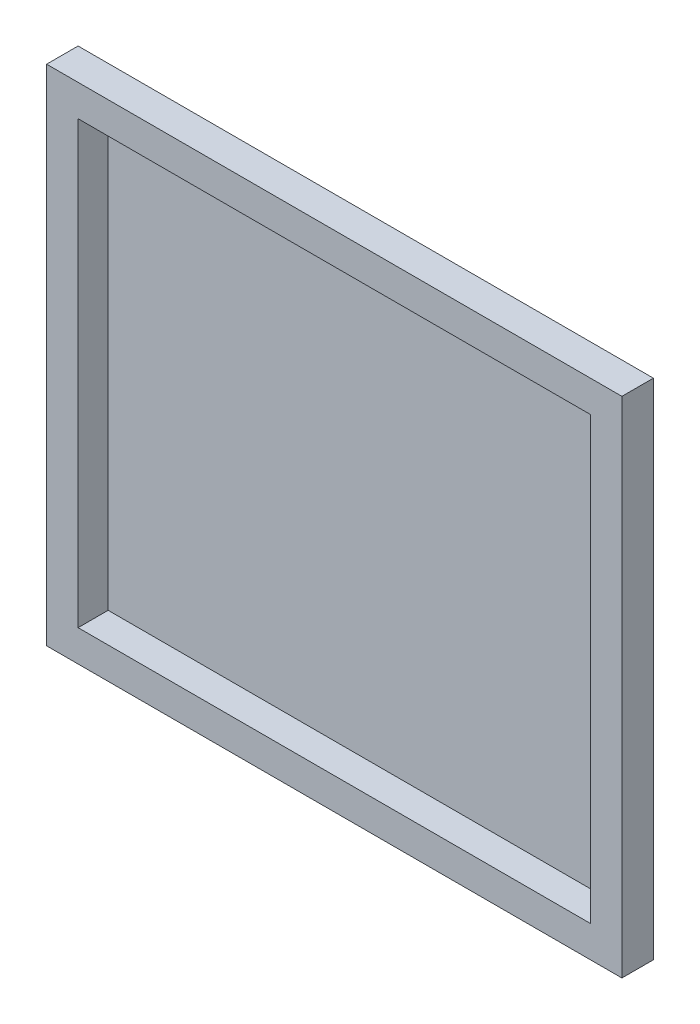
ISO-10303-21;
HEADER;
FILE_DESCRIPTION(('STEP AP214'),'2;1');
FILE_NAME('part.step','',(''),(''),'','','');
FILE_SCHEMA(('AUTOMOTIVE_DESIGN { 1 0 10303 214 1 1 1 1 }'));
ENDSEC;
DATA;
#1=APPLICATION_CONTEXT('core data for automotive mechanical design processes');
#2=APPLICATION_PROTOCOL_DEFINITION('international standard','automotive_design',2000,#1);
#3=PRODUCT_CONTEXT('',#1,'mechanical');
#4=PRODUCT('Part','Part','',(#3));
#5=PRODUCT_RELATED_PRODUCT_CATEGORY('part','',(#4));
#6=PRODUCT_DEFINITION_FORMATION('','',#4);
#7=PRODUCT_DEFINITION_CONTEXT('part definition',#1,'design');
#8=PRODUCT_DEFINITION('design','',#6,#7);
#9=PRODUCT_DEFINITION_SHAPE('','',#8);
#10=(LENGTH_UNIT() NAMED_UNIT(*) SI_UNIT(.MILLI.,.METRE.));
#11=(NAMED_UNIT(*) PLANE_ANGLE_UNIT() SI_UNIT($,.RADIAN.));
#12=(NAMED_UNIT(*) SI_UNIT($,.STERADIAN.) SOLID_ANGLE_UNIT());
#13=UNCERTAINTY_MEASURE_WITH_UNIT(LENGTH_MEASURE(1.E-05),#10,'distance_accuracy_value','');
#14=(GEOMETRIC_REPRESENTATION_CONTEXT(3) GLOBAL_UNCERTAINTY_ASSIGNED_CONTEXT((#13)) GLOBAL_UNIT_ASSIGNED_CONTEXT((#10,
#11,#12)) REPRESENTATION_CONTEXT('',''));
#15=CARTESIAN_POINT('',(0.,0.,0.));
#16=DIRECTION('',(0.,0.,1.));
#17=DIRECTION('',(1.,0.,0.));
#18=AXIS2_PLACEMENT_3D('',#15,#16,#17);
#19=CARTESIAN_POINT('',(0.,0.,1.));
#20=DIRECTION('',(0.,0.,1.));
#21=DIRECTION('',(1.,0.,0.));
#22=AXIS2_PLACEMENT_3D('',#19,#20,#21);
#23=PLANE('',#22);
#24=DIRECTION('',(0.,-1.,0.));
#25=VECTOR('',#24,1.);
#26=CARTESIAN_POINT('',(380.,0.,1.));
#27=LINE('',#26,#25);
#28=CARTESIAN_POINT('',(380.,-22.,1.));
#29=VERTEX_POINT('',#28);
#30=CARTESIAN_POINT('',(380.,-330.,1.));
#31=VERTEX_POINT('',#30);
#32=EDGE_CURVE('E154',#29,#31,#27,.T.);
#33=ORIENTED_EDGE('',*,*,#32,.F.);
#34=DIRECTION('',(1.,0.,0.));
#35=VECTOR('',#34,1.);
#36=CARTESIAN_POINT('',(0.,-22.,1.));
#37=LINE('',#36,#35);
#38=CARTESIAN_POINT('',(22.,-22.,1.));
#39=VERTEX_POINT('',#38);
#40=EDGE_CURVE('E156',#39,#29,#37,.T.);
#41=ORIENTED_EDGE('',*,*,#40,.F.);
#42=DIRECTION('',(0.,-1.,0.));
#43=VECTOR('',#42,1.);
#44=CARTESIAN_POINT('',(22.,0.,1.));
#45=LINE('',#44,#43);
#46=CARTESIAN_POINT('',(22.,-330.,1.));
#47=VERTEX_POINT('',#46);
#48=EDGE_CURVE('E40',#39,#47,#45,.T.);
#49=ORIENTED_EDGE('',*,*,#48,.T.);
#50=DIRECTION('',(1.,0.,0.));
#51=VECTOR('',#50,1.);
#52=CARTESIAN_POINT('',(0.,-330.,1.));
#53=LINE('',#52,#51);
#54=EDGE_CURVE('E11',#47,#31,#53,.T.);
#55=ORIENTED_EDGE('',*,*,#54,.T.);
#56=EDGE_LOOP('',(#33,#41,#49,#55));
#57=FACE_BOUND('',#56,.T.);
#58=ADVANCED_FACE('F32',(#57),#23,.T.);
#59=CARTESIAN_POINT('',(0.,0.,22.));
#60=DIRECTION('',(0.,0.,1.));
#61=DIRECTION('',(1.,0.,0.));
#62=AXIS2_PLACEMENT_3D('',#59,#60,#61);
#63=PLANE('',#62);
#64=DIRECTION('',(0.,-1.,0.));
#65=VECTOR('',#64,1.);
#66=CARTESIAN_POINT('',(0.,0.,22.));
#67=LINE('',#66,#65);
#68=CARTESIAN_POINT('',(0.,0.,22.));
#69=VERTEX_POINT('',#68);
#70=CARTESIAN_POINT('',(0.,-352.,22.));
#71=VERTEX_POINT('',#70);
#72=EDGE_CURVE('E125',#69,#71,#67,.T.);
#73=ORIENTED_EDGE('',*,*,#72,.T.);
#74=DIRECTION('',(1.,0.,0.));
#75=VECTOR('',#74,1.);
#76=CARTESIAN_POINT('',(0.,-352.,22.));
#77=LINE('',#76,#75);
#78=CARTESIAN_POINT('',(402.,-352.,22.));
#79=VERTEX_POINT('',#78);
#80=EDGE_CURVE('E128',#71,#79,#77,.T.);
#81=ORIENTED_EDGE('',*,*,#80,.T.);
#82=DIRECTION('',(0.,1.,0.));
#83=VECTOR('',#82,1.);
#84=CARTESIAN_POINT('',(402.,0.,22.));
#85=LINE('',#84,#83);
#86=CARTESIAN_POINT('',(402.,0.,22.));
#87=VERTEX_POINT('',#86);
#88=EDGE_CURVE('E131',#79,#87,#85,.T.);
#89=ORIENTED_EDGE('',*,*,#88,.T.);
#90=DIRECTION('',(-1.,0.,0.));
#91=VECTOR('',#90,1.);
#92=CARTESIAN_POINT('',(0.,0.,22.));
#93=LINE('',#92,#91);
#94=EDGE_CURVE('E133',#87,#69,#93,.T.);
#95=ORIENTED_EDGE('',*,*,#94,.T.);
#96=EDGE_LOOP('',(#73,#81,#89,#95));
#97=FACE_BOUND('',#96,.T.);
#98=DIRECTION('',(1.,0.,0.));
#99=VECTOR('',#98,1.);
#100=CARTESIAN_POINT('',(22.,-330.,22.));
#101=LINE('',#100,#99);
#102=CARTESIAN_POINT('',(22.,-330.,22.));
#103=VERTEX_POINT('',#102);
#104=CARTESIAN_POINT('',(380.,-330.,22.));
#105=VERTEX_POINT('',#104);
#106=EDGE_CURVE('E102',#103,#105,#101,.T.);
#107=ORIENTED_EDGE('',*,*,#106,.F.);
#108=DIRECTION('',(0.,-1.,0.));
#109=VECTOR('',#108,1.);
#110=CARTESIAN_POINT('',(22.,-22.,22.));
#111=LINE('',#110,#109);
#112=CARTESIAN_POINT('',(22.,-22.,22.));
#113=VERTEX_POINT('',#112);
#114=EDGE_CURVE('E93',#113,#103,#111,.T.);
#115=ORIENTED_EDGE('',*,*,#114,.F.);
#116=DIRECTION('',(-1.,0.,0.));
#117=VECTOR('',#116,1.);
#118=CARTESIAN_POINT('',(22.,-22.,22.));
#119=LINE('',#118,#117);
#120=CARTESIAN_POINT('',(380.,-22.,22.));
#121=VERTEX_POINT('',#120);
#122=EDGE_CURVE('E116',#121,#113,#119,.T.);
#123=ORIENTED_EDGE('',*,*,#122,.F.);
#124=DIRECTION('',(0.,1.,0.));
#125=VECTOR('',#124,1.);
#126=CARTESIAN_POINT('',(380.,-22.,22.));
#127=LINE('',#126,#125);
#128=EDGE_CURVE('E114',#105,#121,#127,.T.);
#129=ORIENTED_EDGE('',*,*,#128,.F.);
#130=EDGE_LOOP('',(#107,#115,#123,#129));
#131=FACE_BOUND('',#130,.T.);
#132=ADVANCED_FACE('F112',(#97,#131),#63,.T.);
#133=CARTESIAN_POINT('',(0.,0.,22.));
#134=DIRECTION('',(1.,0.,0.));
#135=DIRECTION('',(0.,0.,-1.));
#136=AXIS2_PLACEMENT_3D('',#133,#134,#135);
#137=PLANE('',#136);
#138=DIRECTION('',(0.,-1.,0.));
#139=VECTOR('',#138,1.);
#140=CARTESIAN_POINT('',(0.,0.,0.));
#141=LINE('',#140,#139);
#142=CARTESIAN_POINT('',(0.,0.,0.));
#143=VERTEX_POINT('',#142);
#144=CARTESIAN_POINT('',(0.,-352.,0.));
#145=VERTEX_POINT('',#144);
#146=EDGE_CURVE('E108',#143,#145,#141,.T.);
#147=ORIENTED_EDGE('',*,*,#146,.T.);
#148=DIRECTION('',(0.,0.,-1.));
#149=VECTOR('',#148,1.);
#150=CARTESIAN_POINT('',(0.,-352.,22.));
#151=LINE('',#150,#149);
#152=EDGE_CURVE('E151',#71,#145,#151,.T.);
#153=ORIENTED_EDGE('',*,*,#152,.F.);
#154=ORIENTED_EDGE('',*,*,#72,.F.);
#155=DIRECTION('',(0.,0.,-1.));
#156=VECTOR('',#155,1.);
#157=CARTESIAN_POINT('',(0.,0.,22.));
#158=LINE('',#157,#156);
#159=EDGE_CURVE('E135',#69,#143,#158,.T.);
#160=ORIENTED_EDGE('',*,*,#159,.T.);
#161=EDGE_LOOP('',(#147,#153,#154,#160));
#162=FACE_BOUND('',#161,.T.);
#163=ADVANCED_FACE('F166',(#162),#137,.F.);
#164=CARTESIAN_POINT('',(0.,-352.,22.));
#165=DIRECTION('',(0.,1.,0.));
#166=DIRECTION('',(0.,0.,1.));
#167=AXIS2_PLACEMENT_3D('',#164,#165,#166);
#168=PLANE('',#167);
#169=DIRECTION('',(1.,0.,0.));
#170=VECTOR('',#169,1.);
#171=CARTESIAN_POINT('',(0.,-352.,0.));
#172=LINE('',#171,#170);
#173=CARTESIAN_POINT('',(402.,-352.,0.));
#174=VERTEX_POINT('',#173);
#175=EDGE_CURVE('E138',#145,#174,#172,.T.);
#176=ORIENTED_EDGE('',*,*,#175,.T.);
#177=DIRECTION('',(0.,0.,-1.));
#178=VECTOR('',#177,1.);
#179=CARTESIAN_POINT('',(402.,-352.,22.));
#180=LINE('',#179,#178);
#181=EDGE_CURVE('E148',#79,#174,#180,.T.);
#182=ORIENTED_EDGE('',*,*,#181,.F.);
#183=ORIENTED_EDGE('',*,*,#80,.F.);
#184=ORIENTED_EDGE('',*,*,#152,.T.);
#185=EDGE_LOOP('',(#176,#182,#183,#184));
#186=FACE_BOUND('',#185,.T.);
#187=ADVANCED_FACE('F172',(#186),#168,.F.);
#188=CARTESIAN_POINT('',(402.,0.,22.));
#189=DIRECTION('',(-1.,0.,0.));
#190=DIRECTION('',(0.,-1.,0.));
#191=AXIS2_PLACEMENT_3D('',#188,#189,#190);
#192=PLANE('',#191);
#193=DIRECTION('',(0.,1.,0.));
#194=VECTOR('',#193,1.);
#195=CARTESIAN_POINT('',(402.,0.,0.));
#196=LINE('',#195,#194);
#197=CARTESIAN_POINT('',(402.,0.,0.));
#198=VERTEX_POINT('',#197);
#199=EDGE_CURVE('E140',#174,#198,#196,.T.);
#200=ORIENTED_EDGE('',*,*,#199,.T.);
#201=DIRECTION('',(0.,0.,-1.));
#202=VECTOR('',#201,1.);
#203=CARTESIAN_POINT('',(402.,0.,22.));
#204=LINE('',#203,#202);
#205=EDGE_CURVE('E145',#87,#198,#204,.T.);
#206=ORIENTED_EDGE('',*,*,#205,.F.);
#207=ORIENTED_EDGE('',*,*,#88,.F.);
#208=ORIENTED_EDGE('',*,*,#181,.T.);
#209=EDGE_LOOP('',(#200,#206,#207,#208));
#210=FACE_BOUND('',#209,.T.);
#211=ADVANCED_FACE('F176',(#210),#192,.F.);
#212=CARTESIAN_POINT('',(0.,0.,22.));
#213=DIRECTION('',(0.,-1.,0.));
#214=DIRECTION('',(0.,0.,-1.));
#215=AXIS2_PLACEMENT_3D('',#212,#213,#214);
#216=PLANE('',#215);
#217=DIRECTION('',(-1.,0.,0.));
#218=VECTOR('',#217,1.);
#219=CARTESIAN_POINT('',(0.,0.,0.));
#220=LINE('',#219,#218);
#221=EDGE_CURVE('E129',#198,#143,#220,.T.);
#222=ORIENTED_EDGE('',*,*,#221,.T.);
#223=ORIENTED_EDGE('',*,*,#159,.F.);
#224=ORIENTED_EDGE('',*,*,#94,.F.);
#225=ORIENTED_EDGE('',*,*,#205,.T.);
#226=EDGE_LOOP('',(#222,#223,#224,#225));
#227=FACE_BOUND('',#226,.T.);
#228=ADVANCED_FACE('F180',(#227),#216,.F.);
#229=CARTESIAN_POINT('',(22.,-22.,22.));
#230=DIRECTION('',(1.,0.,0.));
#231=DIRECTION('',(0.,1.,0.));
#232=AXIS2_PLACEMENT_3D('',#229,#230,#231);
#233=PLANE('',#232);
#234=DIRECTION('',(0.,0.,-1.));
#235=VECTOR('',#234,1.);
#236=CARTESIAN_POINT('',(22.,-330.,22.));
#237=LINE('',#236,#235);
#238=EDGE_CURVE('E96',#103,#47,#237,.T.);
#239=ORIENTED_EDGE('',*,*,#238,.T.);
#240=ORIENTED_EDGE('',*,*,#48,.F.);
#241=DIRECTION('',(0.,0.,-1.));
#242=VECTOR('',#241,1.);
#243=CARTESIAN_POINT('',(22.,-22.,22.));
#244=LINE('',#243,#242);
#245=EDGE_CURVE('E98',#113,#39,#244,.T.);
#246=ORIENTED_EDGE('',*,*,#245,.F.);
#247=ORIENTED_EDGE('',*,*,#114,.T.);
#248=EDGE_LOOP('',(#239,#240,#246,#247));
#249=FACE_BOUND('',#248,.T.);
#250=ADVANCED_FACE('F95',(#249),#233,.T.);
#251=CARTESIAN_POINT('',(22.,-330.,22.));
#252=DIRECTION('',(0.,1.,0.));
#253=DIRECTION('',(0.,0.,1.));
#254=AXIS2_PLACEMENT_3D('',#251,#252,#253);
#255=PLANE('',#254);
#256=DIRECTION('',(0.,0.,-1.));
#257=VECTOR('',#256,1.);
#258=CARTESIAN_POINT('',(380.,-330.,22.));
#259=LINE('',#258,#257);
#260=EDGE_CURVE('E109',#105,#31,#259,.T.);
#261=ORIENTED_EDGE('',*,*,#260,.T.);
#262=ORIENTED_EDGE('',*,*,#54,.F.);
#263=ORIENTED_EDGE('',*,*,#238,.F.);
#264=ORIENTED_EDGE('',*,*,#106,.T.);
#265=EDGE_LOOP('',(#261,#262,#263,#264));
#266=FACE_BOUND('',#265,.T.);
#267=ADVANCED_FACE('F106',(#266),#255,.T.);
#268=CARTESIAN_POINT('',(380.,-22.,22.));
#269=DIRECTION('',(-1.,0.,0.));
#270=DIRECTION('',(0.,-1.,0.));
#271=AXIS2_PLACEMENT_3D('',#268,#269,#270);
#272=PLANE('',#271);
#273=DIRECTION('',(0.,0.,-1.));
#274=VECTOR('',#273,1.);
#275=CARTESIAN_POINT('',(380.,-22.,22.));
#276=LINE('',#275,#274);
#277=EDGE_CURVE('E121',#121,#29,#276,.T.);
#278=ORIENTED_EDGE('',*,*,#277,.T.);
#279=ORIENTED_EDGE('',*,*,#32,.T.);
#280=ORIENTED_EDGE('',*,*,#260,.F.);
#281=ORIENTED_EDGE('',*,*,#128,.T.);
#282=EDGE_LOOP('',(#278,#279,#280,#281));
#283=FACE_BOUND('',#282,.T.);
#284=ADVANCED_FACE('F161',(#283),#272,.T.);
#285=CARTESIAN_POINT('',(22.,-22.,22.));
#286=DIRECTION('',(0.,-1.,0.));
#287=DIRECTION('',(0.,0.,-1.));
#288=AXIS2_PLACEMENT_3D('',#285,#286,#287);
#289=PLANE('',#288);
#290=ORIENTED_EDGE('',*,*,#245,.T.);
#291=ORIENTED_EDGE('',*,*,#40,.T.);
#292=ORIENTED_EDGE('',*,*,#277,.F.);
#293=ORIENTED_EDGE('',*,*,#122,.T.);
#294=EDGE_LOOP('',(#290,#291,#292,#293));
#295=FACE_BOUND('',#294,.T.);
#296=ADVANCED_FACE('F159',(#295),#289,.T.);
#297=CARTESIAN_POINT('',(0.,0.,0.));
#298=DIRECTION('',(0.,0.,1.));
#299=DIRECTION('',(1.,0.,0.));
#300=AXIS2_PLACEMENT_3D('',#297,#298,#299);
#301=PLANE('',#300);
#302=ORIENTED_EDGE('',*,*,#146,.F.);
#303=ORIENTED_EDGE('',*,*,#221,.F.);
#304=ORIENTED_EDGE('',*,*,#199,.F.);
#305=ORIENTED_EDGE('',*,*,#175,.F.);
#306=EDGE_LOOP('',(#302,#303,#304,#305));
#307=FACE_BOUND('',#306,.T.);
#308=ADVANCED_FACE('F34',(#307),#301,.F.);
#309=CLOSED_SHELL('',(#58,#132,#163,#187,#211,#228,#250,#267,#284,#296,#308));
#310=MANIFOLD_SOLID_BREP('B2',#309);
#311=ADVANCED_BREP_SHAPE_REPRESENTATION('',(#18,#310),#14);
#312=SHAPE_DEFINITION_REPRESENTATION(#9,#311);
ENDSEC;
END-ISO-10303-21;
